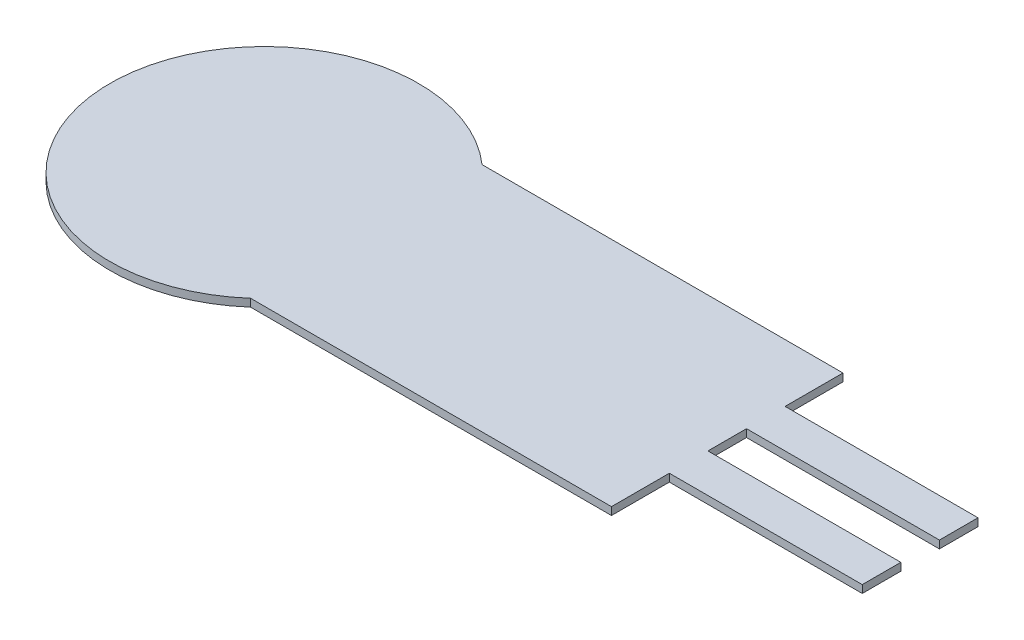
ISO-10303-21;
HEADER;
FILE_DESCRIPTION(('STEP AP214'),'2;1');
FILE_NAME('part.step','',(''),(''),'','','');
FILE_SCHEMA(('AUTOMOTIVE_DESIGN { 1 0 10303 214 1 1 1 1 }'));
ENDSEC;
DATA;
#1=APPLICATION_CONTEXT('core data for automotive mechanical design processes');
#2=APPLICATION_PROTOCOL_DEFINITION('international standard','automotive_design',2000,#1);
#3=PRODUCT_CONTEXT('',#1,'mechanical');
#4=PRODUCT('Part','Part','',(#3));
#5=PRODUCT_RELATED_PRODUCT_CATEGORY('part','',(#4));
#6=PRODUCT_DEFINITION_FORMATION('','',#4);
#7=PRODUCT_DEFINITION_CONTEXT('part definition',#1,'design');
#8=PRODUCT_DEFINITION('design','',#6,#7);
#9=PRODUCT_DEFINITION_SHAPE('','',#8);
#10=(LENGTH_UNIT() NAMED_UNIT(*) SI_UNIT(.MILLI.,.METRE.));
#11=(NAMED_UNIT(*) PLANE_ANGLE_UNIT() SI_UNIT($,.RADIAN.));
#12=(NAMED_UNIT(*) SI_UNIT($,.STERADIAN.) SOLID_ANGLE_UNIT());
#13=UNCERTAINTY_MEASURE_WITH_UNIT(LENGTH_MEASURE(1.E-05),#10,'distance_accuracy_value','');
#14=(GEOMETRIC_REPRESENTATION_CONTEXT(3) GLOBAL_UNCERTAINTY_ASSIGNED_CONTEXT((#13)) GLOBAL_UNIT_ASSIGNED_CONTEXT((#10,
#11,#12)) REPRESENTATION_CONTEXT('',''));
#15=CARTESIAN_POINT('',(0.,0.,0.));
#16=DIRECTION('',(0.,0.,1.));
#17=DIRECTION('',(1.,0.,0.));
#18=AXIS2_PLACEMENT_3D('',#15,#16,#17);
#19=CARTESIAN_POINT('',(12.,0.1,-3.));
#20=DIRECTION('',(-1.,0.,0.));
#21=DIRECTION('',(0.,0.,1.));
#22=AXIS2_PLACEMENT_3D('',#19,#20,#21);
#23=PLANE('',#22);
#24=DIRECTION('',(0.,0.,-1.));
#25=VECTOR('',#24,1.);
#26=CARTESIAN_POINT('',(12.,-0.1,-3.));
#27=LINE('',#26,#25);
#28=CARTESIAN_POINT('',(12.,-0.1,3.));
#29=VERTEX_POINT('',#28);
#30=CARTESIAN_POINT('',(12.,-0.1,1.5));
#31=VERTEX_POINT('',#30);
#32=EDGE_CURVE('E195',#29,#31,#27,.T.);
#33=ORIENTED_EDGE('',*,*,#32,.T.);
#34=DIRECTION('',(0.,-1.,0.));
#35=VECTOR('',#34,1.);
#36=CARTESIAN_POINT('',(12.,0.1,1.5));
#37=LINE('',#36,#35);
#38=CARTESIAN_POINT('',(12.,0.1,1.5));
#39=VERTEX_POINT('',#38);
#40=EDGE_CURVE('E56',#39,#31,#37,.T.);
#41=ORIENTED_EDGE('',*,*,#40,.F.);
#42=DIRECTION('',(0.,0.,-1.));
#43=VECTOR('',#42,1.);
#44=CARTESIAN_POINT('',(12.,0.1,-3.));
#45=LINE('',#44,#43);
#46=CARTESIAN_POINT('',(12.,0.1,3.));
#47=VERTEX_POINT('',#46);
#48=EDGE_CURVE('E142',#47,#39,#45,.T.);
#49=ORIENTED_EDGE('',*,*,#48,.F.);
#50=DIRECTION('',(0.,-1.,0.));
#51=VECTOR('',#50,1.);
#52=CARTESIAN_POINT('',(12.,0.1,3.));
#53=LINE('',#52,#51);
#54=EDGE_CURVE('E202',#47,#29,#53,.T.);
#55=ORIENTED_EDGE('',*,*,#54,.T.);
#56=EDGE_LOOP('',(#33,#41,#49,#55));
#57=FACE_BOUND('',#56,.T.);
#58=ADVANCED_FACE('F33',(#57),#23,.F.);
#59=CARTESIAN_POINT('',(12.,0.1,0.5));
#60=VERTEX_POINT('',#59);
#61=CARTESIAN_POINT('',(12.,0.1,-0.5));
#62=VERTEX_POINT('',#61);
#63=EDGE_CURVE('E48',#60,#62,#45,.T.);
#64=ORIENTED_EDGE('',*,*,#63,.F.);
#65=DIRECTION('',(0.,-1.,0.));
#66=VECTOR('',#65,1.);
#67=CARTESIAN_POINT('',(12.,0.1,0.5));
#68=LINE('',#67,#66);
#69=CARTESIAN_POINT('',(12.,-0.1,0.5));
#70=VERTEX_POINT('',#69);
#71=EDGE_CURVE('E148',#60,#70,#68,.T.);
#72=ORIENTED_EDGE('',*,*,#71,.T.);
#73=CARTESIAN_POINT('',(12.,-0.1,-0.5));
#74=VERTEX_POINT('',#73);
#75=EDGE_CURVE('E197',#70,#74,#27,.T.);
#76=ORIENTED_EDGE('',*,*,#75,.T.);
#77=DIRECTION('',(0.,-1.,0.));
#78=VECTOR('',#77,1.);
#79=CARTESIAN_POINT('',(12.,0.1,-0.5));
#80=LINE('',#79,#78);
#81=EDGE_CURVE('E180',#62,#74,#80,.T.);
#82=ORIENTED_EDGE('',*,*,#81,.F.);
#83=EDGE_LOOP('',(#64,#72,#76,#82));
#84=FACE_BOUND('',#83,.T.);
#85=ADVANCED_FACE('F231',(#84),#23,.F.);
#86=CARTESIAN_POINT('',(0.,0.1,0.));
#87=DIRECTION('',(0.,-1.,0.));
#88=DIRECTION('',(0.,0.,-1.));
#89=AXIS2_PLACEMENT_3D('',#86,#87,#88);
#90=CYLINDRICAL_SURFACE('',#89,4.);
#91=DIRECTION('',(0.,-1.,0.));
#92=VECTOR('',#91,1.);
#93=CARTESIAN_POINT('',(2.64575131106459,0.1,3.));
#94=LINE('',#93,#92);
#95=CARTESIAN_POINT('',(2.64575131106459,0.1,3.));
#96=VERTEX_POINT('',#95);
#97=CARTESIAN_POINT('',(2.64575131106459,-0.1,3.));
#98=VERTEX_POINT('',#97);
#99=EDGE_CURVE('E208',#96,#98,#94,.T.);
#100=ORIENTED_EDGE('',*,*,#99,.F.);
#101=CARTESIAN_POINT('',(0.,0.1,0.));
#102=DIRECTION('',(0.,1.,0.));
#103=DIRECTION('',(0.,0.,1.));
#104=AXIS2_PLACEMENT_3D('',#101,#102,#103);
#105=CIRCLE('',#104,4.);
#106=CARTESIAN_POINT('',(2.64575131106459,0.1,-3.));
#107=VERTEX_POINT('',#106);
#108=EDGE_CURVE('E11',#107,#96,#105,.T.);
#109=ORIENTED_EDGE('',*,*,#108,.F.);
#110=DIRECTION('',(0.,-1.,0.));
#111=VECTOR('',#110,1.);
#112=CARTESIAN_POINT('',(2.64575131106459,0.1,-3.));
#113=LINE('',#112,#111);
#114=CARTESIAN_POINT('',(2.64575131106459,-0.1,-3.));
#115=VERTEX_POINT('',#114);
#116=EDGE_CURVE('E205',#115,#107,#113,.F.);
#117=ORIENTED_EDGE('',*,*,#116,.F.);
#118=CARTESIAN_POINT('',(0.,-0.1,0.));
#119=DIRECTION('',(0.,1.,0.));
#120=DIRECTION('',(0.,0.,1.));
#121=AXIS2_PLACEMENT_3D('',#118,#119,#120);
#122=CIRCLE('',#121,4.);
#123=EDGE_CURVE('E37',#115,#98,#122,.T.);
#124=ORIENTED_EDGE('',*,*,#123,.T.);
#125=EDGE_LOOP('',(#100,#109,#117,#124));
#126=FACE_BOUND('',#125,.T.);
#127=ADVANCED_FACE('F35',(#126),#90,.T.);
#128=CARTESIAN_POINT('',(0.,0.1,0.));
#129=DIRECTION('',(0.,1.,0.));
#130=DIRECTION('',(0.,0.,1.));
#131=AXIS2_PLACEMENT_3D('',#128,#129,#130);
#132=PLANE('',#131);
#133=ORIENTED_EDGE('',*,*,#108,.T.);
#134=DIRECTION('',(1.,0.,0.));
#135=VECTOR('',#134,1.);
#136=CARTESIAN_POINT('',(0.,0.1,3.));
#137=LINE('',#136,#135);
#138=EDGE_CURVE('E184',#96,#47,#137,.T.);
#139=ORIENTED_EDGE('',*,*,#138,.T.);
#140=ORIENTED_EDGE('',*,*,#48,.T.);
#141=DIRECTION('',(-1.,0.,0.));
#142=VECTOR('',#141,1.);
#143=CARTESIAN_POINT('',(12.,0.1,1.5));
#144=LINE('',#143,#142);
#145=CARTESIAN_POINT('',(17.,0.1,1.5));
#146=VERTEX_POINT('',#145);
#147=EDGE_CURVE('E127',#146,#39,#144,.T.);
#148=ORIENTED_EDGE('',*,*,#147,.F.);
#149=DIRECTION('',(0.,0.,1.));
#150=VECTOR('',#149,1.);
#151=CARTESIAN_POINT('',(17.,0.1,1.5));
#152=LINE('',#151,#150);
#153=CARTESIAN_POINT('',(17.,0.1,0.5));
#154=VERTEX_POINT('',#153);
#155=EDGE_CURVE('E140',#154,#146,#152,.T.);
#156=ORIENTED_EDGE('',*,*,#155,.F.);
#157=DIRECTION('',(1.,0.,0.));
#158=VECTOR('',#157,1.);
#159=CARTESIAN_POINT('',(12.,0.1,0.5));
#160=LINE('',#159,#158);
#161=EDGE_CURVE('E146',#60,#154,#160,.T.);
#162=ORIENTED_EDGE('',*,*,#161,.F.);
#163=ORIENTED_EDGE('',*,*,#63,.T.);
#164=DIRECTION('',(1.,0.,0.));
#165=VECTOR('',#164,1.);
#166=CARTESIAN_POINT('',(12.,0.1,-0.5));
#167=LINE('',#166,#165);
#168=CARTESIAN_POINT('',(17.,0.1,-0.5));
#169=VERTEX_POINT('',#168);
#170=EDGE_CURVE('E160',#62,#169,#167,.T.);
#171=ORIENTED_EDGE('',*,*,#170,.T.);
#172=DIRECTION('',(0.,0.,-1.));
#173=VECTOR('',#172,1.);
#174=CARTESIAN_POINT('',(17.,0.1,-1.5));
#175=LINE('',#174,#173);
#176=CARTESIAN_POINT('',(17.,0.1,-1.5));
#177=VERTEX_POINT('',#176);
#178=EDGE_CURVE('E162',#169,#177,#175,.T.);
#179=ORIENTED_EDGE('',*,*,#178,.T.);
#180=DIRECTION('',(-1.,0.,0.));
#181=VECTOR('',#180,1.);
#182=CARTESIAN_POINT('',(12.,0.1,-1.5));
#183=LINE('',#182,#181);
#184=CARTESIAN_POINT('',(12.,0.1,-1.5));
#185=VERTEX_POINT('',#184);
#186=EDGE_CURVE('E165',#177,#185,#183,.T.);
#187=ORIENTED_EDGE('',*,*,#186,.T.);
#188=CARTESIAN_POINT('',(12.,0.1,-3.));
#189=VERTEX_POINT('',#188);
#190=EDGE_CURVE('E186',#185,#189,#45,.T.);
#191=ORIENTED_EDGE('',*,*,#190,.T.);
#192=DIRECTION('',(-1.,0.,0.));
#193=VECTOR('',#192,1.);
#194=CARTESIAN_POINT('',(0.,0.1,-3.));
#195=LINE('',#194,#193);
#196=EDGE_CURVE('E189',#189,#107,#195,.T.);
#197=ORIENTED_EDGE('',*,*,#196,.T.);
#198=EDGE_LOOP('',(#133,#139,#140,#148,#156,#162,#163,#171,#179,#187,#191,#197));
#199=FACE_BOUND('',#198,.T.);
#200=ADVANCED_FACE('F138',(#199),#132,.T.);
#201=CARTESIAN_POINT('',(0.,-0.1,0.));
#202=DIRECTION('',(0.,1.,0.));
#203=DIRECTION('',(0.,0.,1.));
#204=AXIS2_PLACEMENT_3D('',#201,#202,#203);
#205=PLANE('',#204);
#206=ORIENTED_EDGE('',*,*,#123,.F.);
#207=DIRECTION('',(-1.,0.,0.));
#208=VECTOR('',#207,1.);
#209=CARTESIAN_POINT('',(0.,-0.1,-3.));
#210=LINE('',#209,#208);
#211=CARTESIAN_POINT('',(12.,-0.1,-3.));
#212=VERTEX_POINT('',#211);
#213=EDGE_CURVE('E187',#212,#115,#210,.T.);
#214=ORIENTED_EDGE('',*,*,#213,.F.);
#215=CARTESIAN_POINT('',(12.,-0.1,-1.5));
#216=VERTEX_POINT('',#215);
#217=EDGE_CURVE('E194',#216,#212,#27,.T.);
#218=ORIENTED_EDGE('',*,*,#217,.F.);
#219=DIRECTION('',(-1.,0.,0.));
#220=VECTOR('',#219,1.);
#221=CARTESIAN_POINT('',(12.,-0.1,-1.5));
#222=LINE('',#221,#220);
#223=CARTESIAN_POINT('',(17.,-0.1,-1.5));
#224=VERTEX_POINT('',#223);
#225=EDGE_CURVE('E163',#224,#216,#222,.T.);
#226=ORIENTED_EDGE('',*,*,#225,.F.);
#227=DIRECTION('',(0.,0.,-1.));
#228=VECTOR('',#227,1.);
#229=CARTESIAN_POINT('',(17.,-0.1,-1.5));
#230=LINE('',#229,#228);
#231=CARTESIAN_POINT('',(17.,-0.1,-0.5));
#232=VERTEX_POINT('',#231);
#233=EDGE_CURVE('E169',#232,#224,#230,.T.);
#234=ORIENTED_EDGE('',*,*,#233,.F.);
#235=DIRECTION('',(1.,0.,0.));
#236=VECTOR('',#235,1.);
#237=CARTESIAN_POINT('',(12.,-0.1,-0.5));
#238=LINE('',#237,#236);
#239=EDGE_CURVE('E159',#74,#232,#238,.T.);
#240=ORIENTED_EDGE('',*,*,#239,.F.);
#241=ORIENTED_EDGE('',*,*,#75,.F.);
#242=DIRECTION('',(1.,0.,0.));
#243=VECTOR('',#242,1.);
#244=CARTESIAN_POINT('',(12.,-0.1,0.5));
#245=LINE('',#244,#243);
#246=CARTESIAN_POINT('',(17.,-0.1,0.5));
#247=VERTEX_POINT('',#246);
#248=EDGE_CURVE('E143',#70,#247,#245,.T.);
#249=ORIENTED_EDGE('',*,*,#248,.T.);
#250=DIRECTION('',(0.,0.,1.));
#251=VECTOR('',#250,1.);
#252=CARTESIAN_POINT('',(17.,-0.1,1.5));
#253=LINE('',#252,#251);
#254=CARTESIAN_POINT('',(17.,-0.1,1.5));
#255=VERTEX_POINT('',#254);
#256=EDGE_CURVE('E152',#247,#255,#253,.T.);
#257=ORIENTED_EDGE('',*,*,#256,.T.);
#258=DIRECTION('',(-1.,0.,0.));
#259=VECTOR('',#258,1.);
#260=CARTESIAN_POINT('',(12.,-0.1,1.5));
#261=LINE('',#260,#259);
#262=EDGE_CURVE('E129',#255,#31,#261,.T.);
#263=ORIENTED_EDGE('',*,*,#262,.T.);
#264=ORIENTED_EDGE('',*,*,#32,.F.);
#265=DIRECTION('',(1.,0.,0.));
#266=VECTOR('',#265,1.);
#267=CARTESIAN_POINT('',(0.,-0.1,3.));
#268=LINE('',#267,#266);
#269=EDGE_CURVE('E183',#98,#29,#268,.T.);
#270=ORIENTED_EDGE('',*,*,#269,.F.);
#271=EDGE_LOOP('',(#206,#214,#218,#226,#234,#240,#241,#249,#257,#263,#264,#270));
#272=FACE_BOUND('',#271,.T.);
#273=ADVANCED_FACE('F217',(#272),#205,.F.);
#274=CARTESIAN_POINT('',(0.,0.1,3.));
#275=DIRECTION('',(0.,0.,-1.));
#276=DIRECTION('',(-1.,0.,0.));
#277=AXIS2_PLACEMENT_3D('',#274,#275,#276);
#278=PLANE('',#277);
#279=ORIENTED_EDGE('',*,*,#138,.F.);
#280=ORIENTED_EDGE('',*,*,#99,.T.);
#281=ORIENTED_EDGE('',*,*,#269,.T.);
#282=ORIENTED_EDGE('',*,*,#54,.F.);
#283=EDGE_LOOP('',(#279,#280,#281,#282));
#284=FACE_BOUND('',#283,.T.);
#285=ADVANCED_FACE('F221',(#284),#278,.F.);
#286=CARTESIAN_POINT('',(0.,0.1,-3.));
#287=DIRECTION('',(0.,0.,1.));
#288=DIRECTION('',(1.,0.,0.));
#289=AXIS2_PLACEMENT_3D('',#286,#287,#288);
#290=PLANE('',#289);
#291=ORIENTED_EDGE('',*,*,#213,.T.);
#292=ORIENTED_EDGE('',*,*,#116,.T.);
#293=ORIENTED_EDGE('',*,*,#196,.F.);
#294=DIRECTION('',(0.,-1.,0.));
#295=VECTOR('',#294,1.);
#296=CARTESIAN_POINT('',(12.,0.1,-3.));
#297=LINE('',#296,#295);
#298=EDGE_CURVE('E192',#189,#212,#297,.T.);
#299=ORIENTED_EDGE('',*,*,#298,.T.);
#300=EDGE_LOOP('',(#291,#292,#293,#299));
#301=FACE_BOUND('',#300,.T.);
#302=ADVANCED_FACE('F247',(#301),#290,.F.);
#303=ORIENTED_EDGE('',*,*,#190,.F.);
#304=DIRECTION('',(0.,-1.,0.));
#305=VECTOR('',#304,1.);
#306=CARTESIAN_POINT('',(12.,0.1,-1.5));
#307=LINE('',#306,#305);
#308=EDGE_CURVE('E167',#185,#216,#307,.T.);
#309=ORIENTED_EDGE('',*,*,#308,.T.);
#310=ORIENTED_EDGE('',*,*,#217,.T.);
#311=ORIENTED_EDGE('',*,*,#298,.F.);
#312=EDGE_LOOP('',(#303,#309,#310,#311));
#313=FACE_BOUND('',#312,.T.);
#314=ADVANCED_FACE('F244',(#313),#23,.F.);
#315=CARTESIAN_POINT('',(12.,0.1,-0.5));
#316=DIRECTION('',(0.,0.,-1.));
#317=DIRECTION('',(-1.,0.,0.));
#318=AXIS2_PLACEMENT_3D('',#315,#316,#317);
#319=PLANE('',#318);
#320=ORIENTED_EDGE('',*,*,#239,.T.);
#321=DIRECTION('',(0.,-1.,0.));
#322=VECTOR('',#321,1.);
#323=CARTESIAN_POINT('',(17.,0.1,-0.5));
#324=LINE('',#323,#322);
#325=EDGE_CURVE('E177',#169,#232,#324,.T.);
#326=ORIENTED_EDGE('',*,*,#325,.F.);
#327=ORIENTED_EDGE('',*,*,#170,.F.);
#328=ORIENTED_EDGE('',*,*,#81,.T.);
#329=EDGE_LOOP('',(#320,#326,#327,#328));
#330=FACE_BOUND('',#329,.T.);
#331=ADVANCED_FACE('F229',(#330),#319,.F.);
#332=CARTESIAN_POINT('',(17.,0.1,-1.5));
#333=DIRECTION('',(-1.,0.,0.));
#334=DIRECTION('',(0.,0.,1.));
#335=AXIS2_PLACEMENT_3D('',#332,#333,#334);
#336=PLANE('',#335);
#337=ORIENTED_EDGE('',*,*,#233,.T.);
#338=DIRECTION('',(0.,-1.,0.));
#339=VECTOR('',#338,1.);
#340=CARTESIAN_POINT('',(17.,0.1,-1.5));
#341=LINE('',#340,#339);
#342=EDGE_CURVE('E174',#177,#224,#341,.T.);
#343=ORIENTED_EDGE('',*,*,#342,.F.);
#344=ORIENTED_EDGE('',*,*,#178,.F.);
#345=ORIENTED_EDGE('',*,*,#325,.T.);
#346=EDGE_LOOP('',(#337,#343,#344,#345));
#347=FACE_BOUND('',#346,.T.);
#348=ADVANCED_FACE('F235',(#347),#336,.F.);
#349=CARTESIAN_POINT('',(12.,0.1,-1.5));
#350=DIRECTION('',(0.,0.,1.));
#351=DIRECTION('',(1.,0.,0.));
#352=AXIS2_PLACEMENT_3D('',#349,#350,#351);
#353=PLANE('',#352);
#354=ORIENTED_EDGE('',*,*,#225,.T.);
#355=ORIENTED_EDGE('',*,*,#308,.F.);
#356=ORIENTED_EDGE('',*,*,#186,.F.);
#357=ORIENTED_EDGE('',*,*,#342,.T.);
#358=EDGE_LOOP('',(#354,#355,#356,#357));
#359=FACE_BOUND('',#358,.T.);
#360=ADVANCED_FACE('F242',(#359),#353,.F.);
#361=CARTESIAN_POINT('',(12.,0.1,1.5));
#362=DIRECTION('',(0.,0.,1.));
#363=DIRECTION('',(1.,0.,0.));
#364=AXIS2_PLACEMENT_3D('',#361,#362,#363);
#365=PLANE('',#364);
#366=ORIENTED_EDGE('',*,*,#262,.F.);
#367=DIRECTION('',(0.,-1.,0.));
#368=VECTOR('',#367,1.);
#369=CARTESIAN_POINT('',(17.,0.1,1.5));
#370=LINE('',#369,#368);
#371=EDGE_CURVE('E124',#146,#255,#370,.T.);
#372=ORIENTED_EDGE('',*,*,#371,.F.);
#373=ORIENTED_EDGE('',*,*,#147,.T.);
#374=ORIENTED_EDGE('',*,*,#40,.T.);
#375=EDGE_LOOP('',(#366,#372,#373,#374));
#376=FACE_BOUND('',#375,.T.);
#377=ADVANCED_FACE('F126',(#376),#365,.T.);
#378=CARTESIAN_POINT('',(17.,0.1,1.5));
#379=DIRECTION('',(1.,0.,0.));
#380=DIRECTION('',(0.,0.,-1.));
#381=AXIS2_PLACEMENT_3D('',#378,#379,#380);
#382=PLANE('',#381);
#383=ORIENTED_EDGE('',*,*,#256,.F.);
#384=DIRECTION('',(0.,-1.,0.));
#385=VECTOR('',#384,1.);
#386=CARTESIAN_POINT('',(17.,0.1,0.5));
#387=LINE('',#386,#385);
#388=EDGE_CURVE('E134',#154,#247,#387,.T.);
#389=ORIENTED_EDGE('',*,*,#388,.F.);
#390=ORIENTED_EDGE('',*,*,#155,.T.);
#391=ORIENTED_EDGE('',*,*,#371,.T.);
#392=EDGE_LOOP('',(#383,#389,#390,#391));
#393=FACE_BOUND('',#392,.T.);
#394=ADVANCED_FACE('F145',(#393),#382,.T.);
#395=CARTESIAN_POINT('',(12.,0.1,0.5));
#396=DIRECTION('',(0.,0.,-1.));
#397=DIRECTION('',(-1.,0.,0.));
#398=AXIS2_PLACEMENT_3D('',#395,#396,#397);
#399=PLANE('',#398);
#400=ORIENTED_EDGE('',*,*,#248,.F.);
#401=ORIENTED_EDGE('',*,*,#71,.F.);
#402=ORIENTED_EDGE('',*,*,#161,.T.);
#403=ORIENTED_EDGE('',*,*,#388,.T.);
#404=EDGE_LOOP('',(#400,#401,#402,#403));
#405=FACE_BOUND('',#404,.T.);
#406=ADVANCED_FACE('F225',(#405),#399,.T.);
#407=CLOSED_SHELL('',(#58,#85,#127,#200,#273,#285,#302,#314,#331,#348,#360,#377,#394,#406));
#408=MANIFOLD_SOLID_BREP('B2',#407);
#409=ADVANCED_BREP_SHAPE_REPRESENTATION('',(#18,#408),#14);
#410=SHAPE_DEFINITION_REPRESENTATION(#9,#409);
ENDSEC;
END-ISO-10303-21;
